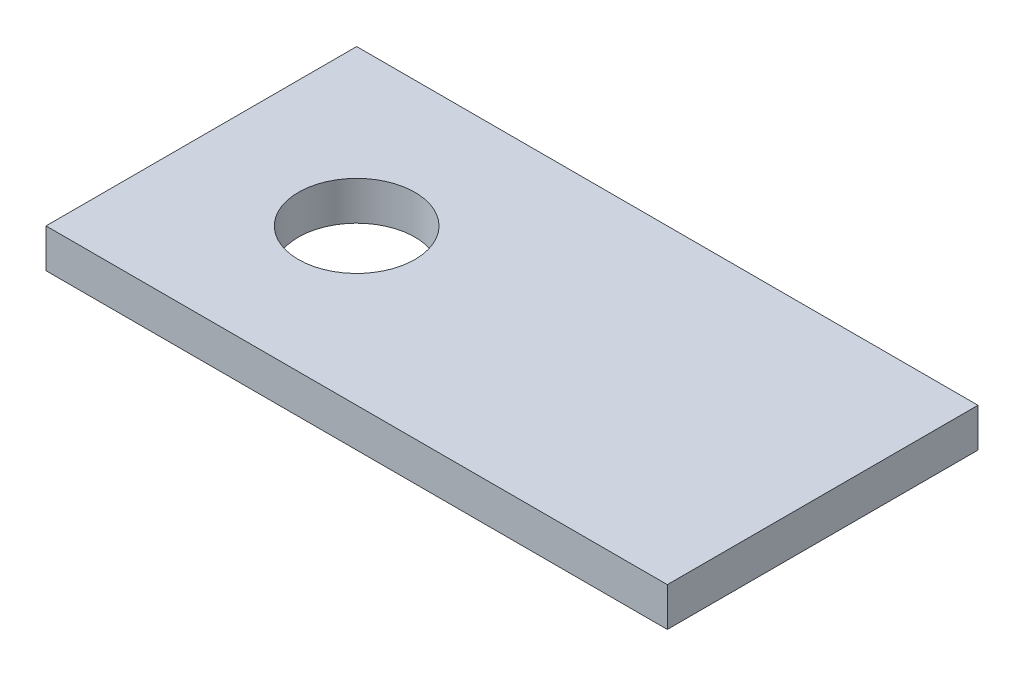
ISO-10303-21;
HEADER;
FILE_DESCRIPTION(('STEP AP214'),'2;1');
FILE_NAME('part.step','',(''),(''),'','','');
FILE_SCHEMA(('AUTOMOTIVE_DESIGN { 1 0 10303 214 1 1 1 1 }'));
ENDSEC;
DATA;
#1=APPLICATION_CONTEXT('core data for automotive mechanical design processes');
#2=APPLICATION_PROTOCOL_DEFINITION('international standard','automotive_design',2000,#1);
#3=PRODUCT_CONTEXT('',#1,'mechanical');
#4=PRODUCT('Part','Part','',(#3));
#5=PRODUCT_RELATED_PRODUCT_CATEGORY('part','',(#4));
#6=PRODUCT_DEFINITION_FORMATION('','',#4);
#7=PRODUCT_DEFINITION_CONTEXT('part definition',#1,'design');
#8=PRODUCT_DEFINITION('design','',#6,#7);
#9=PRODUCT_DEFINITION_SHAPE('','',#8);
#10=(LENGTH_UNIT() NAMED_UNIT(*) SI_UNIT(.MILLI.,.METRE.));
#11=(NAMED_UNIT(*) PLANE_ANGLE_UNIT() SI_UNIT($,.RADIAN.));
#12=(NAMED_UNIT(*) SI_UNIT($,.STERADIAN.) SOLID_ANGLE_UNIT());
#13=UNCERTAINTY_MEASURE_WITH_UNIT(LENGTH_MEASURE(1.E-05),#10,'distance_accuracy_value','');
#14=(GEOMETRIC_REPRESENTATION_CONTEXT(3) GLOBAL_UNCERTAINTY_ASSIGNED_CONTEXT((#13)) GLOBAL_UNIT_ASSIGNED_CONTEXT((#10,
#11,#12)) REPRESENTATION_CONTEXT('',''));
#15=CARTESIAN_POINT('',(0.,0.,0.));
#16=DIRECTION('',(0.,0.,1.));
#17=DIRECTION('',(1.,0.,0.));
#18=AXIS2_PLACEMENT_3D('',#15,#16,#17);
#19=CARTESIAN_POINT('',(-25.4,3.175,-12.7));
#20=DIRECTION('',(1.,0.,0.));
#21=DIRECTION('',(0.,0.,-1.));
#22=AXIS2_PLACEMENT_3D('',#19,#20,#21);
#23=PLANE('',#22);
#24=DIRECTION('',(0.,0.,1.));
#25=VECTOR('',#24,1.);
#26=CARTESIAN_POINT('',(-25.4,0.,-12.7));
#27=LINE('',#26,#25);
#28=CARTESIAN_POINT('',(-25.4,0.,-12.7));
#29=VERTEX_POINT('',#28);
#30=CARTESIAN_POINT('',(-25.4,0.,12.7));
#31=VERTEX_POINT('',#30);
#32=EDGE_CURVE('E100',#29,#31,#27,.T.);
#33=ORIENTED_EDGE('',*,*,#32,.T.);
#34=DIRECTION('',(0.,-1.,0.));
#35=VECTOR('',#34,1.);
#36=CARTESIAN_POINT('',(-25.4,3.175,12.7));
#37=LINE('',#36,#35);
#38=CARTESIAN_POINT('',(-25.4,3.175,12.7));
#39=VERTEX_POINT('',#38);
#40=EDGE_CURVE('E11',#39,#31,#37,.T.);
#41=ORIENTED_EDGE('',*,*,#40,.F.);
#42=DIRECTION('',(0.,0.,1.));
#43=VECTOR('',#42,1.);
#44=CARTESIAN_POINT('',(-25.4,3.175,-12.7));
#45=LINE('',#44,#43);
#46=CARTESIAN_POINT('',(-25.4,3.175,-12.7));
#47=VERTEX_POINT('',#46);
#48=EDGE_CURVE('E88',#47,#39,#45,.T.);
#49=ORIENTED_EDGE('',*,*,#48,.F.);
#50=DIRECTION('',(0.,-1.,0.));
#51=VECTOR('',#50,1.);
#52=CARTESIAN_POINT('',(-25.4,3.175,-12.7));
#53=LINE('',#52,#51);
#54=EDGE_CURVE('E96',#47,#29,#53,.T.);
#55=ORIENTED_EDGE('',*,*,#54,.T.);
#56=EDGE_LOOP('',(#33,#41,#49,#55));
#57=FACE_BOUND('',#56,.T.);
#58=ADVANCED_FACE('F37',(#57),#23,.F.);
#59=CARTESIAN_POINT('',(-25.4,3.175,12.7));
#60=DIRECTION('',(0.,0.,-1.));
#61=DIRECTION('',(-1.,0.,0.));
#62=AXIS2_PLACEMENT_3D('',#59,#60,#61);
#63=PLANE('',#62);
#64=DIRECTION('',(1.,0.,0.));
#65=VECTOR('',#64,1.);
#66=CARTESIAN_POINT('',(-25.4,0.,12.7));
#67=LINE('',#66,#65);
#68=CARTESIAN_POINT('',(25.4,0.,12.7));
#69=VERTEX_POINT('',#68);
#70=EDGE_CURVE('E92',#31,#69,#67,.T.);
#71=ORIENTED_EDGE('',*,*,#70,.T.);
#72=DIRECTION('',(0.,-1.,0.));
#73=VECTOR('',#72,1.);
#74=CARTESIAN_POINT('',(25.4,3.175,12.7));
#75=LINE('',#74,#73);
#76=CARTESIAN_POINT('',(25.4,3.175,12.7));
#77=VERTEX_POINT('',#76);
#78=EDGE_CURVE('E45',#77,#69,#75,.T.);
#79=ORIENTED_EDGE('',*,*,#78,.F.);
#80=DIRECTION('',(1.,0.,0.));
#81=VECTOR('',#80,1.);
#82=CARTESIAN_POINT('',(-25.4,3.175,12.7));
#83=LINE('',#82,#81);
#84=EDGE_CURVE('E83',#39,#77,#83,.T.);
#85=ORIENTED_EDGE('',*,*,#84,.F.);
#86=ORIENTED_EDGE('',*,*,#40,.T.);
#87=EDGE_LOOP('',(#71,#79,#85,#86));
#88=FACE_BOUND('',#87,.T.);
#89=ADVANCED_FACE('F91',(#88),#63,.F.);
#90=CARTESIAN_POINT('',(25.4,3.175,-12.7));
#91=DIRECTION('',(-1.,0.,0.));
#92=DIRECTION('',(0.,0.,1.));
#93=AXIS2_PLACEMENT_3D('',#90,#91,#92);
#94=PLANE('',#93);
#95=DIRECTION('',(0.,0.,-1.));
#96=VECTOR('',#95,1.);
#97=CARTESIAN_POINT('',(25.4,0.,-12.7));
#98=LINE('',#97,#96);
#99=CARTESIAN_POINT('',(25.4,0.,-12.7));
#100=VERTEX_POINT('',#99);
#101=EDGE_CURVE('E70',#69,#100,#98,.T.);
#102=ORIENTED_EDGE('',*,*,#101,.T.);
#103=DIRECTION('',(0.,-1.,0.));
#104=VECTOR('',#103,1.);
#105=CARTESIAN_POINT('',(25.4,3.175,-12.7));
#106=LINE('',#105,#104);
#107=CARTESIAN_POINT('',(25.4,3.175,-12.7));
#108=VERTEX_POINT('',#107);
#109=EDGE_CURVE('E93',#108,#100,#106,.T.);
#110=ORIENTED_EDGE('',*,*,#109,.F.);
#111=DIRECTION('',(0.,0.,-1.));
#112=VECTOR('',#111,1.);
#113=CARTESIAN_POINT('',(25.4,3.175,-12.7));
#114=LINE('',#113,#112);
#115=EDGE_CURVE('E86',#77,#108,#114,.T.);
#116=ORIENTED_EDGE('',*,*,#115,.F.);
#117=ORIENTED_EDGE('',*,*,#78,.T.);
#118=EDGE_LOOP('',(#102,#110,#116,#117));
#119=FACE_BOUND('',#118,.T.);
#120=ADVANCED_FACE('F94',(#119),#94,.F.);
#121=CARTESIAN_POINT('',(-25.4,3.175,-12.7));
#122=DIRECTION('',(0.,0.,1.));
#123=DIRECTION('',(1.,0.,0.));
#124=AXIS2_PLACEMENT_3D('',#121,#122,#123);
#125=PLANE('',#124);
#126=DIRECTION('',(-1.,0.,0.));
#127=VECTOR('',#126,1.);
#128=CARTESIAN_POINT('',(-25.4,0.,-12.7));
#129=LINE('',#128,#127);
#130=EDGE_CURVE('E76',#100,#29,#129,.T.);
#131=ORIENTED_EDGE('',*,*,#130,.T.);
#132=ORIENTED_EDGE('',*,*,#54,.F.);
#133=DIRECTION('',(-1.,0.,0.));
#134=VECTOR('',#133,1.);
#135=CARTESIAN_POINT('',(-25.4,3.175,-12.7));
#136=LINE('',#135,#134);
#137=EDGE_CURVE('E53',#108,#47,#136,.T.);
#138=ORIENTED_EDGE('',*,*,#137,.F.);
#139=ORIENTED_EDGE('',*,*,#109,.T.);
#140=EDGE_LOOP('',(#131,#132,#138,#139));
#141=FACE_BOUND('',#140,.T.);
#142=ADVANCED_FACE('F108',(#141),#125,.F.);
#143=CARTESIAN_POINT('',(0.,3.175,0.));
#144=DIRECTION('',(0.,1.,0.));
#145=DIRECTION('',(0.,0.,1.));
#146=AXIS2_PLACEMENT_3D('',#143,#144,#145);
#147=PLANE('',#146);
#148=CARTESIAN_POINT('',(-12.7,3.175,0.));
#149=DIRECTION('',(0.,1.,0.));
#150=DIRECTION('',(0.,0.,1.));
#151=AXIS2_PLACEMENT_3D('',#148,#149,#150);
#152=CIRCLE('',#151,4.7625);
#153=CARTESIAN_POINT('',(-12.7,3.175,4.7625));
#154=VERTEX_POINT('',#153);
#155=EDGE_CURVE('E114',#154,#154,#152,.T.);
#156=ORIENTED_EDGE('',*,*,#155,.F.);
#157=EDGE_LOOP('',(#156));
#158=FACE_BOUND('',#157,.T.);
#159=ORIENTED_EDGE('',*,*,#48,.T.);
#160=ORIENTED_EDGE('',*,*,#84,.T.);
#161=ORIENTED_EDGE('',*,*,#115,.T.);
#162=ORIENTED_EDGE('',*,*,#137,.T.);
#163=EDGE_LOOP('',(#159,#160,#161,#162));
#164=FACE_BOUND('',#163,.T.);
#165=ADVANCED_FACE('F84',(#158,#164),#147,.T.);
#166=CARTESIAN_POINT('',(0.,0.,0.));
#167=DIRECTION('',(0.,1.,0.));
#168=DIRECTION('',(0.,0.,1.));
#169=AXIS2_PLACEMENT_3D('',#166,#167,#168);
#170=PLANE('',#169);
#171=CARTESIAN_POINT('',(-12.7,0.,0.));
#172=DIRECTION('',(0.,1.,0.));
#173=DIRECTION('',(0.,0.,1.));
#174=AXIS2_PLACEMENT_3D('',#171,#172,#173);
#175=CIRCLE('',#174,4.7625);
#176=CARTESIAN_POINT('',(-12.7,0.,4.7625));
#177=VERTEX_POINT('',#176);
#178=EDGE_CURVE('E103',#177,#177,#175,.T.);
#179=ORIENTED_EDGE('',*,*,#178,.T.);
#180=EDGE_LOOP('',(#179));
#181=FACE_BOUND('',#180,.T.);
#182=ORIENTED_EDGE('',*,*,#32,.F.);
#183=ORIENTED_EDGE('',*,*,#130,.F.);
#184=ORIENTED_EDGE('',*,*,#101,.F.);
#185=ORIENTED_EDGE('',*,*,#70,.F.);
#186=EDGE_LOOP('',(#182,#183,#184,#185));
#187=FACE_BOUND('',#186,.T.);
#188=ADVANCED_FACE('F111',(#181,#187),#170,.F.);
#189=CARTESIAN_POINT('',(-12.7,0.,0.));
#190=DIRECTION('',(0.,1.,0.));
#191=DIRECTION('',(0.,0.,1.));
#192=AXIS2_PLACEMENT_3D('',#189,#190,#191);
#193=CYLINDRICAL_SURFACE('',#192,4.7625);
#194=ORIENTED_EDGE('',*,*,#178,.F.);
#195=EDGE_LOOP('',(#194));
#196=FACE_BOUND('',#195,.T.);
#197=ORIENTED_EDGE('',*,*,#155,.T.);
#198=EDGE_LOOP('',(#197));
#199=FACE_BOUND('',#198,.T.);
#200=ADVANCED_FACE('F121',(#196,#199),#193,.F.);
#201=CLOSED_SHELL('',(#58,#89,#120,#142,#165,#188,#200));
#202=MANIFOLD_SOLID_BREP('B2',#201);
#203=ADVANCED_BREP_SHAPE_REPRESENTATION('',(#18,#202),#14);
#204=SHAPE_DEFINITION_REPRESENTATION(#9,#203);
ENDSEC;
END-ISO-10303-21;
